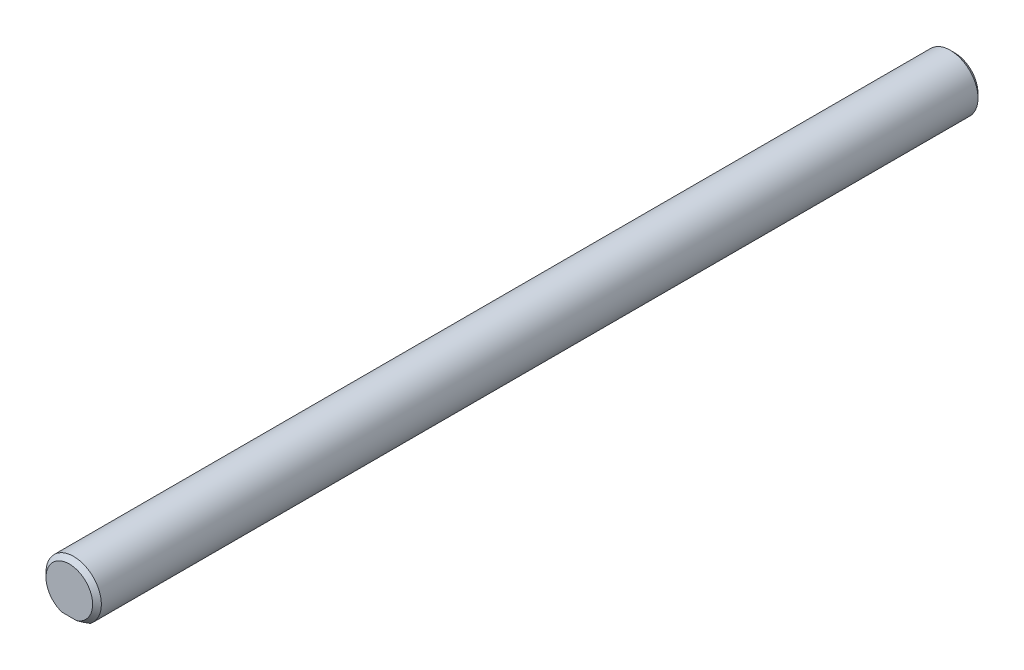
ISO-10303-21;
HEADER;
FILE_DESCRIPTION(('STEP AP214'),'2;1');
FILE_NAME('part.step','',(''),(''),'','','');
FILE_SCHEMA(('AUTOMOTIVE_DESIGN { 1 0 10303 214 1 1 1 1 }'));
ENDSEC;
DATA;
#1=APPLICATION_CONTEXT('core data for automotive mechanical design processes');
#2=APPLICATION_PROTOCOL_DEFINITION('international standard','automotive_design',2000,#1);
#3=PRODUCT_CONTEXT('',#1,'mechanical');
#4=PRODUCT('Part','Part','',(#3));
#5=PRODUCT_RELATED_PRODUCT_CATEGORY('part','',(#4));
#6=PRODUCT_DEFINITION_FORMATION('','',#4);
#7=PRODUCT_DEFINITION_CONTEXT('part definition',#1,'design');
#8=PRODUCT_DEFINITION('design','',#6,#7);
#9=PRODUCT_DEFINITION_SHAPE('','',#8);
#10=(LENGTH_UNIT() NAMED_UNIT(*) SI_UNIT(.MILLI.,.METRE.));
#11=(NAMED_UNIT(*) PLANE_ANGLE_UNIT() SI_UNIT($,.RADIAN.));
#12=(NAMED_UNIT(*) SI_UNIT($,.STERADIAN.) SOLID_ANGLE_UNIT());
#13=UNCERTAINTY_MEASURE_WITH_UNIT(LENGTH_MEASURE(1.E-05),#10,'distance_accuracy_value','');
#14=(GEOMETRIC_REPRESENTATION_CONTEXT(3) GLOBAL_UNCERTAINTY_ASSIGNED_CONTEXT((#13)) GLOBAL_UNIT_ASSIGNED_CONTEXT((#10,
#11,#12)) REPRESENTATION_CONTEXT('',''));
#15=CARTESIAN_POINT('',(0.,0.,0.));
#16=DIRECTION('',(0.,0.,1.));
#17=DIRECTION('',(1.,0.,0.));
#18=AXIS2_PLACEMENT_3D('',#15,#16,#17);
#19=CARTESIAN_POINT('',(0.,0.,-50.8));
#20=DIRECTION('',(0.,0.,-1.));
#21=DIRECTION('',(-1.,0.,0.));
#22=AXIS2_PLACEMENT_3D('',#19,#20,#21);
#23=PLANE('',#22);
#24=DIRECTION('',(1.,0.,0.));
#25=VECTOR('',#24,1.);
#26=CARTESIAN_POINT('',(-1.90500000000001,-2.54,-50.8));
#27=LINE('',#26,#25);
#28=CARTESIAN_POINT('',(-0.839061976256775,-2.54,-50.8));
#29=VERTEX_POINT('',#28);
#30=CARTESIAN_POINT('',(0.839061976256757,-2.54,-50.8));
#31=VERTEX_POINT('',#30);
#32=EDGE_CURVE('E102',#29,#31,#27,.T.);
#33=ORIENTED_EDGE('',*,*,#32,.F.);
#34=CARTESIAN_POINT('',(0.,0.,-50.8));
#35=DIRECTION('',(0.,0.,-1.));
#36=DIRECTION('',(-1.,0.,0.));
#37=AXIS2_PLACEMENT_3D('',#34,#35,#36);
#38=CIRCLE('',#37,2.67499999999998);
#39=EDGE_CURVE('E47',#29,#31,#38,.T.);
#40=ORIENTED_EDGE('',*,*,#39,.T.);
#41=EDGE_LOOP('',(#33,#40));
#42=FACE_BOUND('',#41,.T.);
#43=ADVANCED_FACE('F37',(#42),#23,.T.);
#44=CARTESIAN_POINT('',(0.,0.,50.8));
#45=DIRECTION('',(0.,0.,-1.));
#46=DIRECTION('',(-1.,0.,0.));
#47=AXIS2_PLACEMENT_3D('',#44,#45,#46);
#48=PLANE('',#47);
#49=DIRECTION('',(1.,0.,0.));
#50=VECTOR('',#49,1.);
#51=CARTESIAN_POINT('',(-1.90499999999999,-2.54,50.8));
#52=LINE('',#51,#50);
#53=CARTESIAN_POINT('',(-0.839061976256845,-2.54,50.8));
#54=VERTEX_POINT('',#53);
#55=CARTESIAN_POINT('',(0.839061976256864,-2.54,50.8));
#56=VERTEX_POINT('',#55);
#57=EDGE_CURVE('E98',#54,#56,#52,.T.);
#58=ORIENTED_EDGE('',*,*,#57,.T.);
#59=CARTESIAN_POINT('',(0.,0.,50.8));
#60=DIRECTION('',(0.,0.,-1.));
#61=DIRECTION('',(-1.,0.,0.));
#62=AXIS2_PLACEMENT_3D('',#59,#60,#61);
#63=CIRCLE('',#62,2.67500000000001);
#64=EDGE_CURVE('E11',#56,#54,#63,.F.);
#65=ORIENTED_EDGE('',*,*,#64,.T.);
#66=EDGE_LOOP('',(#58,#65));
#67=FACE_BOUND('',#66,.T.);
#68=ADVANCED_FACE('F122',(#67),#48,.F.);
#69=CARTESIAN_POINT('',(0.,0.,-50.8));
#70=DIRECTION('',(0.,0.,1.));
#71=DIRECTION('',(1.,0.,0.));
#72=AXIS2_PLACEMENT_3D('',#69,#70,#71);
#73=CYLINDRICAL_SURFACE('',#72,3.175);
#74=DIRECTION('',(0.,0.,1.));
#75=VECTOR('',#74,1.);
#76=CARTESIAN_POINT('',(1.90499999999999,-2.54,-50.8));
#77=LINE('',#76,#75);
#78=CARTESIAN_POINT('',(1.90499999999999,-2.54,-50.3));
#79=VERTEX_POINT('',#78);
#80=CARTESIAN_POINT('',(1.90500000000001,-2.54,50.3));
#81=VERTEX_POINT('',#80);
#82=EDGE_CURVE('E91',#79,#81,#77,.T.);
#83=ORIENTED_EDGE('',*,*,#82,.F.);
#84=CARTESIAN_POINT('',(0.,0.,-50.3));
#85=DIRECTION('',(0.,0.,-1.));
#86=DIRECTION('',(-1.,0.,0.));
#87=AXIS2_PLACEMENT_3D('',#84,#85,#86);
#88=CIRCLE('',#87,3.175);
#89=CARTESIAN_POINT('',(-1.90500000000001,-2.54,-50.3));
#90=VERTEX_POINT('',#89);
#91=EDGE_CURVE('E81',#79,#90,#88,.F.);
#92=ORIENTED_EDGE('',*,*,#91,.T.);
#93=DIRECTION('',(0.,0.,1.));
#94=VECTOR('',#93,1.);
#95=CARTESIAN_POINT('',(-1.90500000000001,-2.54,-50.8));
#96=LINE('',#95,#94);
#97=CARTESIAN_POINT('',(-1.90499999999999,-2.54,50.3));
#98=VERTEX_POINT('',#97);
#99=EDGE_CURVE('E88',#90,#98,#96,.T.);
#100=ORIENTED_EDGE('',*,*,#99,.T.);
#101=CARTESIAN_POINT('',(0.,0.,50.3));
#102=DIRECTION('',(0.,0.,-1.));
#103=DIRECTION('',(-1.,0.,0.));
#104=AXIS2_PLACEMENT_3D('',#101,#102,#103);
#105=CIRCLE('',#104,3.175);
#106=EDGE_CURVE('E93',#98,#81,#105,.T.);
#107=ORIENTED_EDGE('',*,*,#106,.T.);
#108=EDGE_LOOP('',(#83,#92,#100,#107));
#109=FACE_BOUND('',#108,.T.);
#110=ADVANCED_FACE('F87',(#109),#73,.T.);
#111=CARTESIAN_POINT('',(-1.90500000000001,-2.54,-50.8));
#112=DIRECTION('',(0.,-1.,0.));
#113=DIRECTION('',(0.,0.,-1.));
#114=AXIS2_PLACEMENT_3D('',#111,#112,#113);
#115=PLANE('',#114);
#116=ORIENTED_EDGE('',*,*,#99,.F.);
#117=CARTESIAN_POINT('',(-1.90500000000001,-2.54,-50.3));
#118=CARTESIAN_POINT('',(-1.82057616384332,-2.54,-50.3506120790583));
#119=CARTESIAN_POINT('',(-1.73520085655566,-2.54,-50.3997228081613));
#120=CARTESIAN_POINT('',(-1.56255506901465,-2.54,-50.4937439802084));
#121=CARTESIAN_POINT('',(-1.47529205702911,-2.54,-50.5386681953032));
#122=CARTESIAN_POINT('',(-1.29822184149408,-2.54,-50.6235188017369));
#123=CARTESIAN_POINT('',(-1.20841230086508,-2.54,-50.6634404070517));
#124=CARTESIAN_POINT('',(-1.02588565435886,-2.54,-50.7369210885129));
#125=CARTESIAN_POINT('',(-0.933159615756497,-2.54,-50.7704578240664));
#126=CARTESIAN_POINT('',(-0.839061976256774,-2.54,-50.8));
#127=B_SPLINE_CURVE_WITH_KNOTS('',3,(#117,#118,#119,#120,#121,#122,#123,#124,#125,#126),
.UNSPECIFIED.,.F.,.F.,(4,2,2,2,4),(0.,0.295344631156668,0.58968059055052,0.884296027084839,
1.17992410070192),.UNSPECIFIED.);
#128=EDGE_CURVE('E59',#90,#29,#127,.T.);
#129=ORIENTED_EDGE('',*,*,#128,.T.);
#130=ORIENTED_EDGE('',*,*,#32,.T.);
#131=CARTESIAN_POINT('',(0.839061976256757,-2.54,-50.8));
#132=CARTESIAN_POINT('',(0.93315961575648,-2.54,-50.7704578240664));
#133=CARTESIAN_POINT('',(1.02588565435884,-2.54,-50.7369210885129));
#134=CARTESIAN_POINT('',(1.20841230086507,-2.54,-50.6634404070517));
#135=CARTESIAN_POINT('',(1.29822184149406,-2.54,-50.6235188017369));
#136=CARTESIAN_POINT('',(1.4752920570291,-2.54,-50.5386681953032));
#137=CARTESIAN_POINT('',(1.56255506901463,-2.54,-50.4937439802084));
#138=CARTESIAN_POINT('',(1.73520085655565,-2.54,-50.3997228081613));
#139=CARTESIAN_POINT('',(1.8205761638433,-2.54,-50.3506120790583));
#140=CARTESIAN_POINT('',(1.90499999999999,-2.54,-50.3));
#141=B_SPLINE_CURVE_WITH_KNOTS('',3,(#131,#132,#133,#134,#135,#136,#137,#138,#139,#140),
.UNSPECIFIED.,.F.,.F.,(4,2,2,2,4),(0.,0.295628073617079,0.590243510151395,0.884579469545247,
1.17992410070191),.UNSPECIFIED.);
#142=EDGE_CURVE('E82',#31,#79,#141,.T.);
#143=ORIENTED_EDGE('',*,*,#142,.T.);
#144=ORIENTED_EDGE('',*,*,#82,.T.);
#145=CARTESIAN_POINT('',(1.90500000000001,-2.54,50.3));
#146=CARTESIAN_POINT('',(1.82057616384333,-2.54,50.3506120790583));
#147=CARTESIAN_POINT('',(1.73520085655568,-2.54,50.3997228081613));
#148=CARTESIAN_POINT('',(1.56255506901468,-2.54,50.4937439802083));
#149=CARTESIAN_POINT('',(1.47529205702915,-2.54,50.5386681953032));
#150=CARTESIAN_POINT('',(1.29822184149413,-2.54,50.6235188017369));
#151=CARTESIAN_POINT('',(1.20841230086514,-2.54,50.6634404070517));
#152=CARTESIAN_POINT('',(1.02588565435893,-2.54,50.7369210885129));
#153=CARTESIAN_POINT('',(0.93315961575658,-2.54,50.7704578240664));
#154=CARTESIAN_POINT('',(0.839061976256864,-2.54,50.8));
#155=B_SPLINE_CURVE_WITH_KNOTS('',3,(#145,#146,#147,#148,#149,#150,#151,#152,#153,#154),
.UNSPECIFIED.,.F.,.F.,(4,2,2,2,4),(0.,0.295344631156639,0.589680590550475,0.884296027084772,
1.17992410070183),.UNSPECIFIED.);
#156=EDGE_CURVE('E92',#81,#56,#155,.T.);
#157=ORIENTED_EDGE('',*,*,#156,.T.);
#158=ORIENTED_EDGE('',*,*,#57,.F.);
#159=CARTESIAN_POINT('',(-0.839061976256846,-2.54,50.8));
#160=CARTESIAN_POINT('',(-0.933159615756561,-2.54,50.7704578240664));
#161=CARTESIAN_POINT('',(-1.02588565435891,-2.54,50.7369210885129));
#162=CARTESIAN_POINT('',(-1.20841230086512,-2.54,50.6634404070517));
#163=CARTESIAN_POINT('',(-1.29822184149411,-2.54,50.6235188017369));
#164=CARTESIAN_POINT('',(-1.47529205702913,-2.54,50.5386681953032));
#165=CARTESIAN_POINT('',(-1.56255506901466,-2.54,50.4937439802084));
#166=CARTESIAN_POINT('',(-1.73520085655566,-2.54,50.3997228081613));
#167=CARTESIAN_POINT('',(-1.82057616384331,-2.54,50.3506120790583));
#168=CARTESIAN_POINT('',(-1.90499999999999,-2.54,50.3));
#169=B_SPLINE_CURVE_WITH_KNOTS('',3,(#159,#160,#161,#162,#163,#164,#165,#166,#167,#168),
.UNSPECIFIED.,.F.,.F.,(4,2,2,2,4),(0.,0.295628073617054,0.590243510151352,0.884579469545186,
1.17992410070183),.UNSPECIFIED.);
#170=EDGE_CURVE('E97',#54,#98,#169,.T.);
#171=ORIENTED_EDGE('',*,*,#170,.T.);
#172=EDGE_LOOP('',(#116,#129,#130,#143,#144,#157,#158,#171));
#173=FACE_BOUND('',#172,.T.);
#174=ADVANCED_FACE('F95',(#173),#115,.T.);
#175=CARTESIAN_POINT('',(0.,0.,-50.3));
#176=DIRECTION('',(0.,0.,1.));
#177=DIRECTION('',(1.,0.,0.));
#178=AXIS2_PLACEMENT_3D('',#175,#176,#177);
#179=CONICAL_SURFACE('',#178,3.175,0.785398163397451);
#180=ORIENTED_EDGE('',*,*,#142,.F.);
#181=ORIENTED_EDGE('',*,*,#39,.F.);
#182=ORIENTED_EDGE('',*,*,#128,.F.);
#183=ORIENTED_EDGE('',*,*,#91,.F.);
#184=EDGE_LOOP('',(#180,#181,#182,#183));
#185=FACE_BOUND('',#184,.T.);
#186=ADVANCED_FACE('F80',(#185),#179,.T.);
#187=CARTESIAN_POINT('',(0.,0.,50.8));
#188=DIRECTION('',(0.,0.,-1.));
#189=DIRECTION('',(-1.,0.,0.));
#190=AXIS2_PLACEMENT_3D('',#187,#188,#189);
#191=CONICAL_SURFACE('',#190,2.67500000000001,0.785398163397438);
#192=ORIENTED_EDGE('',*,*,#156,.F.);
#193=ORIENTED_EDGE('',*,*,#106,.F.);
#194=ORIENTED_EDGE('',*,*,#170,.F.);
#195=ORIENTED_EDGE('',*,*,#64,.F.);
#196=EDGE_LOOP('',(#192,#193,#194,#195));
#197=FACE_BOUND('',#196,.T.);
#198=ADVANCED_FACE('F40',(#197),#191,.T.);
#199=CLOSED_SHELL('',(#43,#68,#110,#174,#186,#198));
#200=MANIFOLD_SOLID_BREP('B2',#199);
#201=ADVANCED_BREP_SHAPE_REPRESENTATION('',(#18,#200),#14);
#202=SHAPE_DEFINITION_REPRESENTATION(#9,#201);
ENDSEC;
END-ISO-10303-21;
